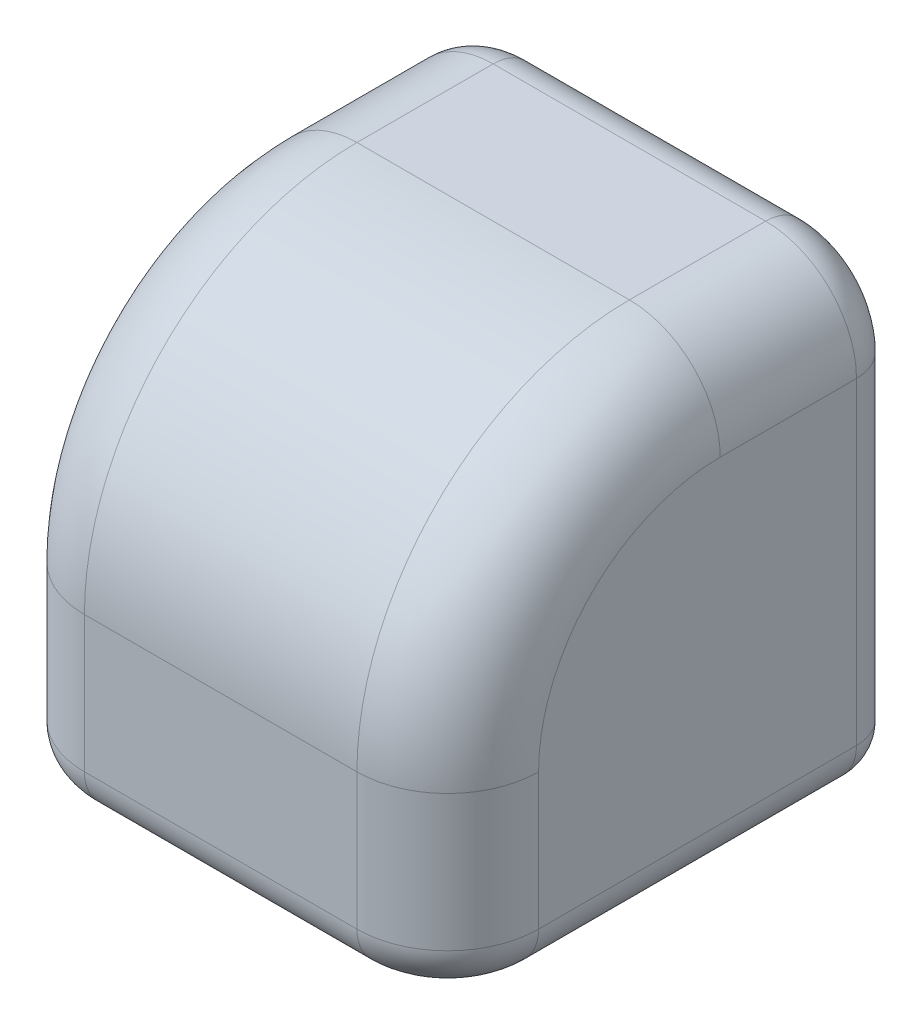
ISO-10303-21;
HEADER;
FILE_DESCRIPTION(('STEP AP214'),'2;1');
FILE_NAME('part.step','',(''),(''),'','','');
FILE_SCHEMA(('AUTOMOTIVE_DESIGN { 1 0 10303 214 1 1 1 1 }'));
ENDSEC;
DATA;
#1=APPLICATION_CONTEXT('core data for automotive mechanical design processes');
#2=APPLICATION_PROTOCOL_DEFINITION('international standard','automotive_design',2000,#1);
#3=PRODUCT_CONTEXT('',#1,'mechanical');
#4=PRODUCT('Part','Part','',(#3));
#5=PRODUCT_RELATED_PRODUCT_CATEGORY('part','',(#4));
#6=PRODUCT_DEFINITION_FORMATION('','',#4);
#7=PRODUCT_DEFINITION_CONTEXT('part definition',#1,'design');
#8=PRODUCT_DEFINITION('design','',#6,#7);
#9=PRODUCT_DEFINITION_SHAPE('','',#8);
#10=(LENGTH_UNIT() NAMED_UNIT(*) SI_UNIT(.MILLI.,.METRE.));
#11=(NAMED_UNIT(*) PLANE_ANGLE_UNIT() SI_UNIT($,.RADIAN.));
#12=(NAMED_UNIT(*) SI_UNIT($,.STERADIAN.) SOLID_ANGLE_UNIT());
#13=UNCERTAINTY_MEASURE_WITH_UNIT(LENGTH_MEASURE(1.E-05),#10,'distance_accuracy_value','');
#14=(GEOMETRIC_REPRESENTATION_CONTEXT(3) GLOBAL_UNCERTAINTY_ASSIGNED_CONTEXT((#13)) GLOBAL_UNIT_ASSIGNED_CONTEXT((#10,
#11,#12)) REPRESENTATION_CONTEXT('',''));
#15=CARTESIAN_POINT('',(0.,0.,0.));
#16=DIRECTION('',(0.,0.,1.));
#17=DIRECTION('',(1.,0.,0.));
#18=AXIS2_PLACEMENT_3D('',#15,#16,#17);
#19=CARTESIAN_POINT('',(0.,0.,0.));
#20=DIRECTION('',(0.,1.,0.));
#21=DIRECTION('',(0.,0.,1.));
#22=AXIS2_PLACEMENT_3D('',#19,#20,#21);
#23=PLANE('',#22);
#24=DIRECTION('',(0.,0.,1.));
#25=VECTOR('',#24,1.);
#26=CARTESIAN_POINT('',(-20.,0.,0.));
#27=LINE('',#26,#25);
#28=CARTESIAN_POINT('',(-20.,0.,0.));
#29=VERTEX_POINT('',#28);
#30=CARTESIAN_POINT('',(-20.,0.,-20.));
#31=VERTEX_POINT('',#30);
#32=EDGE_CURVE('E255',#29,#31,#27,.F.);
#33=ORIENTED_EDGE('',*,*,#32,.T.);
#34=DIRECTION('',(-1.,0.,0.));
#35=VECTOR('',#34,1.);
#36=CARTESIAN_POINT('',(0.,0.,-20.));
#37=LINE('',#36,#35);
#38=CARTESIAN_POINT('',(0.,0.,-20.));
#39=VERTEX_POINT('',#38);
#40=EDGE_CURVE('E11',#31,#39,#37,.F.);
#41=ORIENTED_EDGE('',*,*,#40,.T.);
#42=CARTESIAN_POINT('',(0.,0.,0.));
#43=DIRECTION('',(0.,-1.,0.));
#44=DIRECTION('',(0.,0.,-1.));
#45=AXIS2_PLACEMENT_3D('',#42,#43,#44);
#46=CIRCLE('',#45,20.);
#47=EDGE_CURVE('E556',#29,#39,#46,.T.);
#48=ORIENTED_EDGE('',*,*,#47,.F.);
#49=EDGE_LOOP('',(#33,#41,#48));
#50=FACE_BOUND('',#49,.T.);
#51=ADVANCED_FACE('F41',(#50),#23,.F.);
#52=CARTESIAN_POINT('',(-25.,50.,-25.));
#53=DIRECTION('',(0.,0.,1.));
#54=DIRECTION('',(1.,0.,0.));
#55=AXIS2_PLACEMENT_3D('',#52,#53,#54);
#56=PLANE('',#55);
#57=CARTESIAN_POINT('',(0.,25.,-25.));
#58=DIRECTION('',(0.,0.,-1.));
#59=DIRECTION('',(-1.,0.,0.));
#60=AXIS2_PLACEMENT_3D('',#57,#58,#59);
#61=CIRCLE('',#60,20.);
#62=CARTESIAN_POINT('',(0.,45.,-25.));
#63=VERTEX_POINT('',#62);
#64=CARTESIAN_POINT('',(20.,25.,-25.));
#65=VERTEX_POINT('',#64);
#66=EDGE_CURVE('E481',#63,#65,#61,.T.);
#67=ORIENTED_EDGE('',*,*,#66,.F.);
#68=DIRECTION('',(-1.,0.,0.));
#69=VECTOR('',#68,1.);
#70=CARTESIAN_POINT('',(15.,45.,-25.));
#71=LINE('',#70,#69);
#72=CARTESIAN_POINT('',(15.,45.,-25.));
#73=VERTEX_POINT('',#72);
#74=EDGE_CURVE('E339',#63,#73,#71,.F.);
#75=ORIENTED_EDGE('',*,*,#74,.T.);
#76=CARTESIAN_POINT('',(15.,40.,-25.));
#77=DIRECTION('',(0.,0.,1.));
#78=DIRECTION('',(1.,0.,0.));
#79=AXIS2_PLACEMENT_3D('',#76,#77,#78);
#80=CIRCLE('',#79,5.);
#81=CARTESIAN_POINT('',(20.,40.,-25.));
#82=VERTEX_POINT('',#81);
#83=EDGE_CURVE('E336',#73,#82,#80,.F.);
#84=ORIENTED_EDGE('',*,*,#83,.T.);
#85=DIRECTION('',(0.,-1.,0.));
#86=VECTOR('',#85,1.);
#87=CARTESIAN_POINT('',(20.,50.,-25.));
#88=LINE('',#87,#86);
#89=EDGE_CURVE('E323',#82,#65,#88,.T.);
#90=ORIENTED_EDGE('',*,*,#89,.T.);
#91=EDGE_LOOP('',(#67,#75,#84,#90));
#92=FACE_BOUND('',#91,.T.);
#93=ADVANCED_FACE('F508',(#92),#56,.F.);
#94=CARTESIAN_POINT('',(-15.,40.,-25.));
#95=DIRECTION('',(0.,0.,1.));
#96=DIRECTION('',(1.,0.,0.));
#97=AXIS2_PLACEMENT_3D('',#94,#95,#96);
#98=CIRCLE('',#97,5.);
#99=CARTESIAN_POINT('',(-20.,40.,-25.));
#100=VERTEX_POINT('',#99);
#101=CARTESIAN_POINT('',(-15.,45.,-25.));
#102=VERTEX_POINT('',#101);
#103=EDGE_CURVE('E330',#100,#102,#98,.F.);
#104=ORIENTED_EDGE('',*,*,#103,.T.);
#105=DIRECTION('',(-1.,0.,0.));
#106=VECTOR('',#105,1.);
#107=CARTESIAN_POINT('',(15.,45.,-25.));
#108=LINE('',#107,#106);
#109=EDGE_CURVE('E333',#102,#63,#108,.F.);
#110=ORIENTED_EDGE('',*,*,#109,.T.);
#111=CARTESIAN_POINT('',(-20.,25.,-25.));
#112=VERTEX_POINT('',#111);
#113=EDGE_CURVE('E477',#112,#63,#61,.T.);
#114=ORIENTED_EDGE('',*,*,#113,.F.);
#115=DIRECTION('',(0.,-1.,0.));
#116=VECTOR('',#115,1.);
#117=CARTESIAN_POINT('',(-20.,50.,-25.));
#118=LINE('',#117,#116);
#119=EDGE_CURVE('E327',#112,#100,#118,.F.);
#120=ORIENTED_EDGE('',*,*,#119,.T.);
#121=EDGE_LOOP('',(#104,#110,#114,#120));
#122=FACE_BOUND('',#121,.T.);
#123=ADVANCED_FACE('F512',(#122),#56,.F.);
#124=CARTESIAN_POINT('',(0.,5.,-25.));
#125=VERTEX_POINT('',#124);
#126=EDGE_CURVE('E498',#65,#125,#61,.T.);
#127=ORIENTED_EDGE('',*,*,#126,.F.);
#128=DIRECTION('',(0.,-1.,0.));
#129=VECTOR('',#128,1.);
#130=CARTESIAN_POINT('',(20.,50.,-25.));
#131=LINE('',#130,#129);
#132=CARTESIAN_POINT('',(20.,5.,-25.));
#133=VERTEX_POINT('',#132);
#134=EDGE_CURVE('E320',#65,#133,#131,.T.);
#135=ORIENTED_EDGE('',*,*,#134,.T.);
#136=DIRECTION('',(-1.,0.,0.));
#137=VECTOR('',#136,1.);
#138=CARTESIAN_POINT('',(-25.,5.,-25.));
#139=LINE('',#138,#137);
#140=EDGE_CURVE('E314',#133,#125,#139,.T.);
#141=ORIENTED_EDGE('',*,*,#140,.T.);
#142=EDGE_LOOP('',(#127,#135,#141));
#143=FACE_BOUND('',#142,.T.);
#144=ADVANCED_FACE('F509',(#143),#56,.F.);
#145=CARTESIAN_POINT('',(20.,0.,0.));
#146=VERTEX_POINT('',#145);
#147=EDGE_CURVE('E199',#39,#146,#46,.T.);
#148=ORIENTED_EDGE('',*,*,#147,.F.);
#149=DIRECTION('',(-1.,0.,0.));
#150=VECTOR('',#149,1.);
#151=CARTESIAN_POINT('',(0.,0.,-20.));
#152=LINE('',#151,#150);
#153=CARTESIAN_POINT('',(20.,0.,-20.));
#154=VERTEX_POINT('',#153);
#155=EDGE_CURVE('E51',#39,#154,#152,.F.);
#156=ORIENTED_EDGE('',*,*,#155,.T.);
#157=DIRECTION('',(0.,0.,-1.));
#158=VECTOR('',#157,1.);
#159=CARTESIAN_POINT('',(20.,0.,0.));
#160=LINE('',#159,#158);
#161=EDGE_CURVE('E276',#154,#146,#160,.F.);
#162=ORIENTED_EDGE('',*,*,#161,.T.);
#163=EDGE_LOOP('',(#148,#156,#162));
#164=FACE_BOUND('',#163,.T.);
#165=ADVANCED_FACE('F511',(#164),#23,.F.);
#166=CARTESIAN_POINT('',(0.,0.,20.));
#167=VERTEX_POINT('',#166);
#168=EDGE_CURVE('E486',#146,#167,#46,.T.);
#169=ORIENTED_EDGE('',*,*,#168,.F.);
#170=DIRECTION('',(0.,0.,-1.));
#171=VECTOR('',#170,1.);
#172=CARTESIAN_POINT('',(20.,0.,0.));
#173=LINE('',#172,#171);
#174=CARTESIAN_POINT('',(20.,0.,15.));
#175=VERTEX_POINT('',#174);
#176=EDGE_CURVE('E273',#146,#175,#173,.F.);
#177=ORIENTED_EDGE('',*,*,#176,.T.);
#178=CARTESIAN_POINT('',(15.,0.,15.));
#179=DIRECTION('',(0.,1.,0.));
#180=DIRECTION('',(0.,0.,1.));
#181=AXIS2_PLACEMENT_3D('',#178,#179,#180);
#182=CIRCLE('',#181,5.);
#183=CARTESIAN_POINT('',(15.,0.,20.));
#184=VERTEX_POINT('',#183);
#185=EDGE_CURVE('E270',#175,#184,#182,.F.);
#186=ORIENTED_EDGE('',*,*,#185,.T.);
#187=DIRECTION('',(1.,0.,0.));
#188=VECTOR('',#187,1.);
#189=CARTESIAN_POINT('',(0.,0.,20.));
#190=LINE('',#189,#188);
#191=EDGE_CURVE('E267',#184,#167,#190,.F.);
#192=ORIENTED_EDGE('',*,*,#191,.T.);
#193=EDGE_LOOP('',(#169,#177,#186,#192));
#194=FACE_BOUND('',#193,.T.);
#195=ADVANCED_FACE('F519',(#194),#23,.F.);
#196=CARTESIAN_POINT('',(25.,50.,-25.));
#197=DIRECTION('',(-1.,0.,0.));
#198=DIRECTION('',(0.,0.,1.));
#199=AXIS2_PLACEMENT_3D('',#196,#197,#198);
#200=PLANE('',#199);
#201=DIRECTION('',(0.,0.,-1.));
#202=VECTOR('',#201,1.);
#203=CARTESIAN_POINT('',(25.,5.,-25.));
#204=LINE('',#203,#202);
#205=CARTESIAN_POINT('',(25.,5.,15.));
#206=VERTEX_POINT('',#205);
#207=CARTESIAN_POINT('',(25.,5.,-20.));
#208=VERTEX_POINT('',#207);
#209=EDGE_CURVE('E244',#206,#208,#204,.T.);
#210=ORIENTED_EDGE('',*,*,#209,.T.);
#211=DIRECTION('',(0.,-1.,0.));
#212=VECTOR('',#211,1.);
#213=CARTESIAN_POINT('',(25.,50.,-20.));
#214=LINE('',#213,#212);
#215=CARTESIAN_POINT('',(25.,40.,-20.));
#216=VERTEX_POINT('',#215);
#217=EDGE_CURVE('E184',#208,#216,#214,.F.);
#218=ORIENTED_EDGE('',*,*,#217,.T.);
#219=DIRECTION('',(0.,0.,-1.));
#220=VECTOR('',#219,1.);
#221=CARTESIAN_POINT('',(25.,40.,-4.99999999999999));
#222=LINE('',#221,#220);
#223=CARTESIAN_POINT('',(25.,40.,-4.99999999999999));
#224=VERTEX_POINT('',#223);
#225=EDGE_CURVE('E175',#216,#224,#222,.F.);
#226=ORIENTED_EDGE('',*,*,#225,.T.);
#227=CARTESIAN_POINT('',(25.,20.,-4.99999999999999));
#228=DIRECTION('',(-1.,0.,0.));
#229=DIRECTION('',(0.,0.,1.));
#230=AXIS2_PLACEMENT_3D('',#227,#228,#229);
#231=CIRCLE('',#230,20.);
#232=CARTESIAN_POINT('',(25.,20.,15.));
#233=VERTEX_POINT('',#232);
#234=EDGE_CURVE('E181',#224,#233,#231,.F.);
#235=ORIENTED_EDGE('',*,*,#234,.T.);
#236=DIRECTION('',(0.,-1.,0.));
#237=VECTOR('',#236,1.);
#238=CARTESIAN_POINT('',(25.,50.,15.));
#239=LINE('',#238,#237);
#240=EDGE_CURVE('E206',#233,#206,#239,.T.);
#241=ORIENTED_EDGE('',*,*,#240,.T.);
#242=EDGE_LOOP('',(#210,#218,#226,#235,#241));
#243=FACE_BOUND('',#242,.T.);
#244=ADVANCED_FACE('F178',(#243),#200,.F.);
#245=DIRECTION('',(-1.,0.,0.));
#246=VECTOR('',#245,1.);
#247=CARTESIAN_POINT('',(-25.,5.,-25.));
#248=LINE('',#247,#246);
#249=CARTESIAN_POINT('',(-20.,5.,-25.));
#250=VERTEX_POINT('',#249);
#251=EDGE_CURVE('E311',#125,#250,#248,.T.);
#252=ORIENTED_EDGE('',*,*,#251,.T.);
#253=DIRECTION('',(0.,-1.,0.));
#254=VECTOR('',#253,1.);
#255=CARTESIAN_POINT('',(-20.,50.,-25.));
#256=LINE('',#255,#254);
#257=EDGE_CURVE('E317',#250,#112,#256,.F.);
#258=ORIENTED_EDGE('',*,*,#257,.T.);
#259=EDGE_CURVE('E482',#125,#112,#61,.T.);
#260=ORIENTED_EDGE('',*,*,#259,.F.);
#261=EDGE_LOOP('',(#252,#258,#260));
#262=FACE_BOUND('',#261,.T.);
#263=ADVANCED_FACE('F514',(#262),#56,.F.);
#264=CARTESIAN_POINT('',(-25.,50.,-25.));
#265=DIRECTION('',(1.,0.,0.));
#266=DIRECTION('',(0.,0.,-1.));
#267=AXIS2_PLACEMENT_3D('',#264,#265,#266);
#268=PLANE('',#267);
#269=DIRECTION('',(0.,0.,1.));
#270=VECTOR('',#269,1.);
#271=CARTESIAN_POINT('',(-25.,40.,-25.));
#272=LINE('',#271,#270);
#273=CARTESIAN_POINT('',(-25.,40.,-4.99999999999999));
#274=VERTEX_POINT('',#273);
#275=CARTESIAN_POINT('',(-25.,40.,-20.));
#276=VERTEX_POINT('',#275);
#277=EDGE_CURVE('E228',#274,#276,#272,.F.);
#278=ORIENTED_EDGE('',*,*,#277,.T.);
#279=DIRECTION('',(0.,-1.,0.));
#280=VECTOR('',#279,1.);
#281=CARTESIAN_POINT('',(-25.,50.,-20.));
#282=LINE('',#281,#280);
#283=CARTESIAN_POINT('',(-25.,5.,-20.));
#284=VERTEX_POINT('',#283);
#285=EDGE_CURVE('E353',#276,#284,#282,.T.);
#286=ORIENTED_EDGE('',*,*,#285,.T.);
#287=DIRECTION('',(0.,0.,1.));
#288=VECTOR('',#287,1.);
#289=CARTESIAN_POINT('',(-25.,5.,-25.));
#290=LINE('',#289,#288);
#291=CARTESIAN_POINT('',(-25.,5.,15.));
#292=VERTEX_POINT('',#291);
#293=EDGE_CURVE('E289',#284,#292,#290,.T.);
#294=ORIENTED_EDGE('',*,*,#293,.T.);
#295=DIRECTION('',(0.,-1.,0.));
#296=VECTOR('',#295,1.);
#297=CARTESIAN_POINT('',(-25.,50.,15.));
#298=LINE('',#297,#296);
#299=CARTESIAN_POINT('',(-25.,20.,15.));
#300=VERTEX_POINT('',#299);
#301=EDGE_CURVE('E235',#292,#300,#298,.F.);
#302=ORIENTED_EDGE('',*,*,#301,.T.);
#303=CARTESIAN_POINT('',(-25.,20.,-4.99999999999999));
#304=DIRECTION('',(1.,0.,0.));
#305=DIRECTION('',(0.,0.,-1.));
#306=AXIS2_PLACEMENT_3D('',#303,#304,#305);
#307=CIRCLE('',#306,20.);
#308=EDGE_CURVE('E232',#300,#274,#307,.F.);
#309=ORIENTED_EDGE('',*,*,#308,.T.);
#310=EDGE_LOOP('',(#278,#286,#294,#302,#309));
#311=FACE_BOUND('',#310,.T.);
#312=ADVANCED_FACE('F407',(#311),#268,.F.);
#313=CARTESIAN_POINT('',(-25.,50.,25.));
#314=DIRECTION('',(0.,0.,-1.));
#315=DIRECTION('',(-1.,0.,0.));
#316=AXIS2_PLACEMENT_3D('',#313,#314,#315);
#317=PLANE('',#316);
#318=DIRECTION('',(0.,-1.,0.));
#319=VECTOR('',#318,1.);
#320=CARTESIAN_POINT('',(-15.,50.,25.));
#321=LINE('',#320,#319);
#322=CARTESIAN_POINT('',(-15.,20.,25.));
#323=VERTEX_POINT('',#322);
#324=CARTESIAN_POINT('',(-15.,5.,25.));
#325=VERTEX_POINT('',#324);
#326=EDGE_CURVE('E221',#323,#325,#321,.T.);
#327=ORIENTED_EDGE('',*,*,#326,.T.);
#328=DIRECTION('',(1.,0.,0.));
#329=VECTOR('',#328,1.);
#330=CARTESIAN_POINT('',(-25.,5.,25.));
#331=LINE('',#330,#329);
#332=CARTESIAN_POINT('',(15.,5.,25.));
#333=VERTEX_POINT('',#332);
#334=EDGE_CURVE('E283',#325,#333,#331,.T.);
#335=ORIENTED_EDGE('',*,*,#334,.T.);
#336=DIRECTION('',(0.,-1.,0.));
#337=VECTOR('',#336,1.);
#338=CARTESIAN_POINT('',(15.,50.,25.));
#339=LINE('',#338,#337);
#340=CARTESIAN_POINT('',(15.,20.,25.));
#341=VERTEX_POINT('',#340);
#342=EDGE_CURVE('E209',#333,#341,#339,.F.);
#343=ORIENTED_EDGE('',*,*,#342,.T.);
#344=DIRECTION('',(1.,0.,0.));
#345=VECTOR('',#344,1.);
#346=CARTESIAN_POINT('',(-25.,20.,25.));
#347=LINE('',#346,#345);
#348=EDGE_CURVE('E188',#341,#323,#347,.F.);
#349=ORIENTED_EDGE('',*,*,#348,.T.);
#350=EDGE_LOOP('',(#327,#335,#343,#349));
#351=FACE_BOUND('',#350,.T.);
#352=ADVANCED_FACE('F422',(#351),#317,.F.);
#353=CARTESIAN_POINT('',(0.,50.,0.));
#354=DIRECTION('',(0.,1.,0.));
#355=DIRECTION('',(0.,0.,1.));
#356=AXIS2_PLACEMENT_3D('',#353,#354,#355);
#357=PLANE('',#356);
#358=DIRECTION('',(0.,0.,-1.));
#359=VECTOR('',#358,1.);
#360=CARTESIAN_POINT('',(15.,50.,-25.));
#361=LINE('',#360,#359);
#362=CARTESIAN_POINT('',(15.,50.,-4.99999999999999));
#363=VERTEX_POINT('',#362);
#364=CARTESIAN_POINT('',(15.,50.,-20.));
#365=VERTEX_POINT('',#364);
#366=EDGE_CURVE('E195',#363,#365,#361,.T.);
#367=ORIENTED_EDGE('',*,*,#366,.T.);
#368=DIRECTION('',(-1.,0.,0.));
#369=VECTOR('',#368,1.);
#370=CARTESIAN_POINT('',(-15.,50.,-20.));
#371=LINE('',#370,#369);
#372=CARTESIAN_POINT('',(-15.,50.,-20.));
#373=VERTEX_POINT('',#372);
#374=EDGE_CURVE('E347',#365,#373,#371,.T.);
#375=ORIENTED_EDGE('',*,*,#374,.T.);
#376=DIRECTION('',(0.,0.,1.));
#377=VECTOR('',#376,1.);
#378=CARTESIAN_POINT('',(-15.,50.,-4.99999999999999));
#379=LINE('',#378,#377);
#380=CARTESIAN_POINT('',(-15.,50.,-4.99999999999999));
#381=VERTEX_POINT('',#380);
#382=EDGE_CURVE('E241',#373,#381,#379,.T.);
#383=ORIENTED_EDGE('',*,*,#382,.T.);
#384=DIRECTION('',(1.,0.,0.));
#385=VECTOR('',#384,1.);
#386=CARTESIAN_POINT('',(25.,50.,-4.99999999999999));
#387=LINE('',#386,#385);
#388=EDGE_CURVE('E469',#381,#363,#387,.T.);
#389=ORIENTED_EDGE('',*,*,#388,.T.);
#390=EDGE_LOOP('',(#367,#375,#383,#389));
#391=FACE_BOUND('',#390,.T.);
#392=ADVANCED_FACE('F467',(#391),#357,.T.);
#393=EDGE_CURVE('E491',#167,#29,#46,.T.);
#394=ORIENTED_EDGE('',*,*,#393,.F.);
#395=DIRECTION('',(1.,0.,0.));
#396=VECTOR('',#395,1.);
#397=CARTESIAN_POINT('',(0.,0.,20.));
#398=LINE('',#397,#396);
#399=CARTESIAN_POINT('',(-15.,0.,20.));
#400=VERTEX_POINT('',#399);
#401=EDGE_CURVE('E264',#167,#400,#398,.F.);
#402=ORIENTED_EDGE('',*,*,#401,.T.);
#403=CARTESIAN_POINT('',(-15.,0.,15.));
#404=DIRECTION('',(0.,1.,0.));
#405=DIRECTION('',(0.,0.,1.));
#406=AXIS2_PLACEMENT_3D('',#403,#404,#405);
#407=CIRCLE('',#406,5.);
#408=CARTESIAN_POINT('',(-20.,0.,15.));
#409=VERTEX_POINT('',#408);
#410=EDGE_CURVE('E261',#400,#409,#407,.F.);
#411=ORIENTED_EDGE('',*,*,#410,.T.);
#412=DIRECTION('',(0.,0.,1.));
#413=VECTOR('',#412,1.);
#414=CARTESIAN_POINT('',(-20.,0.,0.));
#415=LINE('',#414,#413);
#416=EDGE_CURVE('E258',#409,#29,#415,.F.);
#417=ORIENTED_EDGE('',*,*,#416,.T.);
#418=EDGE_LOOP('',(#394,#402,#411,#417));
#419=FACE_BOUND('',#418,.T.);
#420=ADVANCED_FACE('F528',(#419),#23,.F.);
#421=CARTESIAN_POINT('',(0.,25.,-20.));
#422=DIRECTION('',(0.,0.,-1.));
#423=DIRECTION('',(-1.,0.,0.));
#424=AXIS2_PLACEMENT_3D('',#421,#422,#423);
#425=CYLINDRICAL_SURFACE('',#424,20.);
#426=CARTESIAN_POINT('',(0.,25.,-20.));
#427=DIRECTION('',(0.,0.,-1.));
#428=DIRECTION('',(-1.,0.,0.));
#429=AXIS2_PLACEMENT_3D('',#426,#427,#428);
#430=CIRCLE('',#429,20.);
#431=CARTESIAN_POINT('',(-20.,25.,-20.));
#432=VERTEX_POINT('',#431);
#433=EDGE_CURVE('E472',#432,#432,#430,.T.);
#434=ORIENTED_EDGE('',*,*,#433,.F.);
#435=EDGE_LOOP('',(#434));
#436=FACE_BOUND('',#435,.T.);
#437=ORIENTED_EDGE('',*,*,#113,.T.);
#438=ORIENTED_EDGE('',*,*,#66,.T.);
#439=ORIENTED_EDGE('',*,*,#126,.T.);
#440=ORIENTED_EDGE('',*,*,#259,.T.);
#441=EDGE_LOOP('',(#437,#438,#439,#440));
#442=FACE_BOUND('',#441,.T.);
#443=ADVANCED_FACE('F506',(#436,#442),#425,.F.);
#444=CARTESIAN_POINT('',(0.,25.,-20.));
#445=DIRECTION('',(0.,0.,-1.));
#446=DIRECTION('',(-1.,0.,0.));
#447=AXIS2_PLACEMENT_3D('',#444,#445,#446);
#448=PLANE('',#447);
#449=ORIENTED_EDGE('',*,*,#433,.T.);
#450=EDGE_LOOP('',(#449));
#451=FACE_BOUND('',#450,.T.);
#452=ADVANCED_FACE('F540',(#451),#448,.T.);
#453=CARTESIAN_POINT('',(0.,2.,0.));
#454=DIRECTION('',(0.,-1.,0.));
#455=DIRECTION('',(0.,0.,-1.));
#456=AXIS2_PLACEMENT_3D('',#453,#454,#455);
#457=CYLINDRICAL_SURFACE('',#456,20.);
#458=CARTESIAN_POINT('',(0.,2.,0.));
#459=DIRECTION('',(0.,-1.,0.));
#460=DIRECTION('',(0.,0.,-1.));
#461=AXIS2_PLACEMENT_3D('',#458,#459,#460);
#462=CIRCLE('',#461,20.);
#463=CARTESIAN_POINT('',(0.,2.,-20.));
#464=VERTEX_POINT('',#463);
#465=EDGE_CURVE('E490',#464,#464,#462,.T.);
#466=ORIENTED_EDGE('',*,*,#465,.F.);
#467=EDGE_LOOP('',(#466));
#468=FACE_BOUND('',#467,.T.);
#469=ORIENTED_EDGE('',*,*,#168,.T.);
#470=ORIENTED_EDGE('',*,*,#393,.T.);
#471=ORIENTED_EDGE('',*,*,#47,.T.);
#472=ORIENTED_EDGE('',*,*,#147,.T.);
#473=EDGE_LOOP('',(#469,#470,#471,#472));
#474=FACE_BOUND('',#473,.T.);
#475=ADVANCED_FACE('F552',(#468,#474),#457,.F.);
#476=CARTESIAN_POINT('',(0.,2.,0.));
#477=DIRECTION('',(0.,-1.,0.));
#478=DIRECTION('',(0.,0.,-1.));
#479=AXIS2_PLACEMENT_3D('',#476,#477,#478);
#480=PLANE('',#479);
#481=ORIENTED_EDGE('',*,*,#465,.T.);
#482=EDGE_LOOP('',(#481));
#483=FACE_BOUND('',#482,.T.);
#484=ADVANCED_FACE('F605',(#483),#480,.T.);
#485=CARTESIAN_POINT('',(0.,20.,-4.99999999999999));
#486=DIRECTION('',(-1.,0.,0.));
#487=DIRECTION('',(0.,0.,1.));
#488=AXIS2_PLACEMENT_3D('',#485,#486,#487);
#489=CYLINDRICAL_SURFACE('',#488,30.);
#490=ORIENTED_EDGE('',*,*,#388,.F.);
#491=CARTESIAN_POINT('',(-15.,20.,-4.99999999999999));
#492=DIRECTION('',(1.,0.,0.));
#493=DIRECTION('',(0.,0.,-1.));
#494=AXIS2_PLACEMENT_3D('',#491,#492,#493);
#495=CIRCLE('',#494,30.);
#496=EDGE_CURVE('E238',#381,#323,#495,.T.);
#497=ORIENTED_EDGE('',*,*,#496,.T.);
#498=ORIENTED_EDGE('',*,*,#348,.F.);
#499=CARTESIAN_POINT('',(15.,20.,-4.99999999999999));
#500=DIRECTION('',(-1.,0.,0.));
#501=DIRECTION('',(0.,0.,1.));
#502=AXIS2_PLACEMENT_3D('',#499,#500,#501);
#503=CIRCLE('',#502,30.);
#504=EDGE_CURVE('E215',#341,#363,#503,.T.);
#505=ORIENTED_EDGE('',*,*,#504,.T.);
#506=EDGE_LOOP('',(#490,#497,#498,#505));
#507=FACE_BOUND('',#506,.T.);
#508=ADVANCED_FACE('F474',(#507),#489,.T.);
#509=CARTESIAN_POINT('',(15.,40.,0.));
#510=DIRECTION('',(0.,0.,1.));
#511=DIRECTION('',(1.,0.,0.));
#512=AXIS2_PLACEMENT_3D('',#509,#510,#511);
#513=CYLINDRICAL_SURFACE('',#512,10.);
#514=ORIENTED_EDGE('',*,*,#225,.F.);
#515=CARTESIAN_POINT('',(15.,40.,-20.));
#516=DIRECTION('',(0.,0.,1.));
#517=DIRECTION('',(1.,0.,0.));
#518=AXIS2_PLACEMENT_3D('',#515,#516,#517);
#519=CIRCLE('',#518,10.);
#520=EDGE_CURVE('E344',#216,#365,#519,.T.);
#521=ORIENTED_EDGE('',*,*,#520,.T.);
#522=ORIENTED_EDGE('',*,*,#366,.F.);
#523=CARTESIAN_POINT('',(15.,40.,-4.99999999999999));
#524=DIRECTION('',(0.,0.,1.));
#525=DIRECTION('',(1.,0.,0.));
#526=AXIS2_PLACEMENT_3D('',#523,#524,#525);
#527=CIRCLE('',#526,10.);
#528=EDGE_CURVE('E192',#224,#363,#527,.T.);
#529=ORIENTED_EDGE('',*,*,#528,.F.);
#530=EDGE_LOOP('',(#514,#521,#522,#529));
#531=FACE_BOUND('',#530,.T.);
#532=ADVANCED_FACE('F193',(#531),#513,.T.);
#533=CARTESIAN_POINT('',(15.,20.,-4.99999999999999));
#534=DIRECTION('',(-1.,0.,0.));
#535=DIRECTION('',(0.,0.,1.));
#536=AXIS2_PLACEMENT_3D('',#533,#534,#535);
#537=TOROIDAL_SURFACE('',#536,20.,10.);
#538=ORIENTED_EDGE('',*,*,#528,.T.);
#539=ORIENTED_EDGE('',*,*,#504,.F.);
#540=CARTESIAN_POINT('',(15.,20.,15.));
#541=DIRECTION('',(0.,-1.,0.));
#542=DIRECTION('',(0.,0.,-1.));
#543=AXIS2_PLACEMENT_3D('',#540,#541,#542);
#544=CIRCLE('',#543,10.);
#545=EDGE_CURVE('E200',#233,#341,#544,.T.);
#546=ORIENTED_EDGE('',*,*,#545,.F.);
#547=ORIENTED_EDGE('',*,*,#234,.F.);
#548=EDGE_LOOP('',(#538,#539,#546,#547));
#549=FACE_BOUND('',#548,.T.);
#550=ADVANCED_FACE('F202',(#549),#537,.T.);
#551=CARTESIAN_POINT('',(15.,50.,15.));
#552=DIRECTION('',(0.,-1.,0.));
#553=DIRECTION('',(0.,0.,-1.));
#554=AXIS2_PLACEMENT_3D('',#551,#552,#553);
#555=CYLINDRICAL_SURFACE('',#554,10.);
#556=ORIENTED_EDGE('',*,*,#342,.F.);
#557=CARTESIAN_POINT('',(15.,5.,15.));
#558=DIRECTION('',(0.,1.,0.));
#559=DIRECTION('',(0.,0.,1.));
#560=AXIS2_PLACEMENT_3D('',#557,#558,#559);
#561=CIRCLE('',#560,10.);
#562=EDGE_CURVE('E280',#333,#206,#561,.T.);
#563=ORIENTED_EDGE('',*,*,#562,.T.);
#564=ORIENTED_EDGE('',*,*,#240,.F.);
#565=ORIENTED_EDGE('',*,*,#545,.T.);
#566=EDGE_LOOP('',(#556,#563,#564,#565));
#567=FACE_BOUND('',#566,.T.);
#568=ADVANCED_FACE('F441',(#567),#555,.T.);
#569=CARTESIAN_POINT('',(-15.,40.,0.));
#570=DIRECTION('',(0.,0.,-1.));
#571=DIRECTION('',(-1.,0.,0.));
#572=AXIS2_PLACEMENT_3D('',#569,#570,#571);
#573=CYLINDRICAL_SURFACE('',#572,10.);
#574=ORIENTED_EDGE('',*,*,#382,.F.);
#575=CARTESIAN_POINT('',(-15.,40.,-20.));
#576=DIRECTION('',(0.,0.,1.));
#577=DIRECTION('',(1.,0.,0.));
#578=AXIS2_PLACEMENT_3D('',#575,#576,#577);
#579=CIRCLE('',#578,10.);
#580=EDGE_CURVE('E350',#373,#276,#579,.T.);
#581=ORIENTED_EDGE('',*,*,#580,.T.);
#582=ORIENTED_EDGE('',*,*,#277,.F.);
#583=CARTESIAN_POINT('',(-15.,40.,-4.99999999999999));
#584=DIRECTION('',(0.,0.,1.));
#585=DIRECTION('',(1.,0.,0.));
#586=AXIS2_PLACEMENT_3D('',#583,#584,#585);
#587=CIRCLE('',#586,10.);
#588=EDGE_CURVE('E223',#381,#274,#587,.T.);
#589=ORIENTED_EDGE('',*,*,#588,.F.);
#590=EDGE_LOOP('',(#574,#581,#582,#589));
#591=FACE_BOUND('',#590,.T.);
#592=ADVANCED_FACE('F404',(#591),#573,.T.);
#593=CARTESIAN_POINT('',(-15.,20.,-4.99999999999999));
#594=DIRECTION('',(1.,0.,0.));
#595=DIRECTION('',(0.,0.,-1.));
#596=AXIS2_PLACEMENT_3D('',#593,#594,#595);
#597=TOROIDAL_SURFACE('',#596,20.,10.);
#598=ORIENTED_EDGE('',*,*,#588,.T.);
#599=ORIENTED_EDGE('',*,*,#308,.F.);
#600=CARTESIAN_POINT('',(-15.,20.,15.));
#601=DIRECTION('',(0.,-1.,0.));
#602=DIRECTION('',(0.,0.,-1.));
#603=AXIS2_PLACEMENT_3D('',#600,#601,#602);
#604=CIRCLE('',#603,10.);
#605=EDGE_CURVE('E245',#323,#300,#604,.T.);
#606=ORIENTED_EDGE('',*,*,#605,.F.);
#607=ORIENTED_EDGE('',*,*,#496,.F.);
#608=EDGE_LOOP('',(#598,#599,#606,#607));
#609=FACE_BOUND('',#608,.T.);
#610=ADVANCED_FACE('F412',(#609),#597,.T.);
#611=CARTESIAN_POINT('',(-15.,50.,15.));
#612=DIRECTION('',(0.,-1.,0.));
#613=DIRECTION('',(0.,0.,-1.));
#614=AXIS2_PLACEMENT_3D('',#611,#612,#613);
#615=CYLINDRICAL_SURFACE('',#614,10.);
#616=ORIENTED_EDGE('',*,*,#301,.F.);
#617=CARTESIAN_POINT('',(-15.,5.,15.));
#618=DIRECTION('',(0.,1.,0.));
#619=DIRECTION('',(0.,0.,1.));
#620=AXIS2_PLACEMENT_3D('',#617,#618,#619);
#621=CIRCLE('',#620,10.);
#622=EDGE_CURVE('E286',#292,#325,#621,.T.);
#623=ORIENTED_EDGE('',*,*,#622,.T.);
#624=ORIENTED_EDGE('',*,*,#326,.F.);
#625=ORIENTED_EDGE('',*,*,#605,.T.);
#626=EDGE_LOOP('',(#616,#623,#624,#625));
#627=FACE_BOUND('',#626,.T.);
#628=ADVANCED_FACE('F416',(#627),#615,.T.);
#629=CARTESIAN_POINT('',(-20.,5.,-25.));
#630=DIRECTION('',(0.,0.,1.));
#631=DIRECTION('',(1.,0.,0.));
#632=AXIS2_PLACEMENT_3D('',#629,#630,#631);
#633=CYLINDRICAL_SURFACE('',#632,5.);
#634=ORIENTED_EDGE('',*,*,#293,.F.);
#635=CARTESIAN_POINT('',(-20.,5.,-20.));
#636=DIRECTION('',(0.,0.,1.));
#637=DIRECTION('',(1.,0.,0.));
#638=AXIS2_PLACEMENT_3D('',#635,#636,#637);
#639=CIRCLE('',#638,5.);
#640=EDGE_CURVE('E65',#284,#31,#639,.T.);
#641=ORIENTED_EDGE('',*,*,#640,.T.);
#642=ORIENTED_EDGE('',*,*,#32,.F.);
#643=ORIENTED_EDGE('',*,*,#416,.F.);
#644=CARTESIAN_POINT('',(-20.,5.,15.));
#645=DIRECTION('',(0.,0.,1.));
#646=DIRECTION('',(1.,0.,0.));
#647=AXIS2_PLACEMENT_3D('',#644,#645,#646);
#648=CIRCLE('',#647,5.);
#649=EDGE_CURVE('E249',#292,#409,#648,.T.);
#650=ORIENTED_EDGE('',*,*,#649,.F.);
#651=EDGE_LOOP('',(#634,#641,#642,#643,#650));
#652=FACE_BOUND('',#651,.T.);
#653=ADVANCED_FACE('F581',(#652),#633,.T.);
#654=CARTESIAN_POINT('',(-15.,5.,15.));
#655=DIRECTION('',(0.,1.,0.));
#656=DIRECTION('',(0.,0.,1.));
#657=AXIS2_PLACEMENT_3D('',#654,#655,#656);
#658=DEGENERATE_TOROIDAL_SURFACE('',#657,5.,5.,.T.);
#659=ORIENTED_EDGE('',*,*,#649,.T.);
#660=ORIENTED_EDGE('',*,*,#410,.F.);
#661=CARTESIAN_POINT('',(-15.,5.,20.));
#662=DIRECTION('',(1.,0.,0.));
#663=DIRECTION('',(0.,0.,-1.));
#664=AXIS2_PLACEMENT_3D('',#661,#662,#663);
#665=CIRCLE('',#664,5.);
#666=EDGE_CURVE('E301',#325,#400,#665,.T.);
#667=ORIENTED_EDGE('',*,*,#666,.F.);
#668=ORIENTED_EDGE('',*,*,#622,.F.);
#669=EDGE_LOOP('',(#659,#660,#667,#668));
#670=FACE_BOUND('',#669,.T.);
#671=ADVANCED_FACE('F428',(#670),#658,.T.);
#672=CARTESIAN_POINT('',(-25.,5.,20.));
#673=DIRECTION('',(1.,0.,0.));
#674=DIRECTION('',(0.,0.,-1.));
#675=AXIS2_PLACEMENT_3D('',#672,#673,#674);
#676=CYLINDRICAL_SURFACE('',#675,5.);
#677=ORIENTED_EDGE('',*,*,#401,.F.);
#678=ORIENTED_EDGE('',*,*,#191,.F.);
#679=CARTESIAN_POINT('',(15.,5.,20.));
#680=DIRECTION('',(1.,0.,0.));
#681=DIRECTION('',(0.,0.,-1.));
#682=AXIS2_PLACEMENT_3D('',#679,#680,#681);
#683=CIRCLE('',#682,5.);
#684=EDGE_CURVE('E297',#333,#184,#683,.T.);
#685=ORIENTED_EDGE('',*,*,#684,.F.);
#686=ORIENTED_EDGE('',*,*,#334,.F.);
#687=ORIENTED_EDGE('',*,*,#666,.T.);
#688=EDGE_LOOP('',(#677,#678,#685,#686,#687));
#689=FACE_BOUND('',#688,.T.);
#690=ADVANCED_FACE('F432',(#689),#676,.T.);
#691=CARTESIAN_POINT('',(15.,5.,15.));
#692=DIRECTION('',(0.,1.,0.));
#693=DIRECTION('',(0.,0.,1.));
#694=AXIS2_PLACEMENT_3D('',#691,#692,#693);
#695=DEGENERATE_TOROIDAL_SURFACE('',#694,5.,5.,.T.);
#696=ORIENTED_EDGE('',*,*,#684,.T.);
#697=ORIENTED_EDGE('',*,*,#185,.F.);
#698=CARTESIAN_POINT('',(20.,5.,15.));
#699=DIRECTION('',(0.,0.,-1.));
#700=DIRECTION('',(-1.,0.,0.));
#701=AXIS2_PLACEMENT_3D('',#698,#699,#700);
#702=CIRCLE('',#701,5.);
#703=EDGE_CURVE('E293',#206,#175,#702,.T.);
#704=ORIENTED_EDGE('',*,*,#703,.F.);
#705=ORIENTED_EDGE('',*,*,#562,.F.);
#706=EDGE_LOOP('',(#696,#697,#704,#705));
#707=FACE_BOUND('',#706,.T.);
#708=ADVANCED_FACE('F438',(#707),#695,.T.);
#709=CARTESIAN_POINT('',(20.,5.,-25.));
#710=DIRECTION('',(0.,0.,-1.));
#711=DIRECTION('',(-1.,0.,0.));
#712=AXIS2_PLACEMENT_3D('',#709,#710,#711);
#713=CYLINDRICAL_SURFACE('',#712,5.);
#714=ORIENTED_EDGE('',*,*,#161,.F.);
#715=CARTESIAN_POINT('',(20.,5.,-20.));
#716=DIRECTION('',(0.,0.,-1.));
#717=DIRECTION('',(-1.,0.,0.));
#718=AXIS2_PLACEMENT_3D('',#715,#716,#717);
#719=CIRCLE('',#718,5.);
#720=EDGE_CURVE('E292',#154,#208,#719,.F.);
#721=ORIENTED_EDGE('',*,*,#720,.T.);
#722=ORIENTED_EDGE('',*,*,#209,.F.);
#723=ORIENTED_EDGE('',*,*,#703,.T.);
#724=ORIENTED_EDGE('',*,*,#176,.F.);
#725=EDGE_LOOP('',(#714,#721,#722,#723,#724));
#726=FACE_BOUND('',#725,.T.);
#727=ADVANCED_FACE('F444',(#726),#713,.T.);
#728=CARTESIAN_POINT('',(-15.,40.,-20.));
#729=DIRECTION('',(0.,0.,1.));
#730=DIRECTION('',(1.,0.,0.));
#731=AXIS2_PLACEMENT_3D('',#728,#729,#730);
#732=DEGENERATE_TOROIDAL_SURFACE('',#731,5.,5.,.T.);
#733=CARTESIAN_POINT('',(-20.,40.,-20.));
#734=DIRECTION('',(0.,-1.,0.));
#735=DIRECTION('',(0.,0.,-1.));
#736=AXIS2_PLACEMENT_3D('',#733,#734,#735);
#737=CIRCLE('',#736,5.);
#738=EDGE_CURVE('E382',#276,#100,#737,.T.);
#739=ORIENTED_EDGE('',*,*,#738,.F.);
#740=ORIENTED_EDGE('',*,*,#580,.F.);
#741=CARTESIAN_POINT('',(-15.,45.,-20.));
#742=DIRECTION('',(1.,0.,0.));
#743=DIRECTION('',(0.,0.,-1.));
#744=AXIS2_PLACEMENT_3D('',#741,#742,#743);
#745=CIRCLE('',#744,5.);
#746=EDGE_CURVE('E45',#102,#373,#745,.T.);
#747=ORIENTED_EDGE('',*,*,#746,.F.);
#748=ORIENTED_EDGE('',*,*,#103,.F.);
#749=EDGE_LOOP('',(#739,#740,#747,#748));
#750=FACE_BOUND('',#749,.T.);
#751=ADVANCED_FACE('F43',(#750),#732,.T.);
#752=CARTESIAN_POINT('',(0.,45.,-20.));
#753=DIRECTION('',(1.,0.,0.));
#754=DIRECTION('',(0.,0.,-1.));
#755=AXIS2_PLACEMENT_3D('',#752,#753,#754);
#756=CYLINDRICAL_SURFACE('',#755,5.);
#757=ORIENTED_EDGE('',*,*,#746,.T.);
#758=ORIENTED_EDGE('',*,*,#374,.F.);
#759=CARTESIAN_POINT('',(15.,45.,-20.));
#760=DIRECTION('',(1.,0.,0.));
#761=DIRECTION('',(0.,0.,-1.));
#762=AXIS2_PLACEMENT_3D('',#759,#760,#761);
#763=CIRCLE('',#762,5.);
#764=EDGE_CURVE('E379',#73,#365,#763,.T.);
#765=ORIENTED_EDGE('',*,*,#764,.F.);
#766=ORIENTED_EDGE('',*,*,#74,.F.);
#767=ORIENTED_EDGE('',*,*,#109,.F.);
#768=EDGE_LOOP('',(#757,#758,#765,#766,#767));
#769=FACE_BOUND('',#768,.T.);
#770=ADVANCED_FACE('F395',(#769),#756,.T.);
#771=CARTESIAN_POINT('',(-20.,50.,-20.));
#772=DIRECTION('',(0.,-1.,0.));
#773=DIRECTION('',(0.,0.,-1.));
#774=AXIS2_PLACEMENT_3D('',#771,#772,#773);
#775=CYLINDRICAL_SURFACE('',#774,5.);
#776=ORIENTED_EDGE('',*,*,#119,.F.);
#777=ORIENTED_EDGE('',*,*,#257,.F.);
#778=CARTESIAN_POINT('',(-20.,5.,-20.));
#779=DIRECTION('',(0.,-1.,0.));
#780=DIRECTION('',(0.,0.,-1.));
#781=AXIS2_PLACEMENT_3D('',#778,#779,#780);
#782=CIRCLE('',#781,5.);
#783=EDGE_CURVE('E375',#284,#250,#782,.T.);
#784=ORIENTED_EDGE('',*,*,#783,.F.);
#785=ORIENTED_EDGE('',*,*,#285,.F.);
#786=ORIENTED_EDGE('',*,*,#738,.T.);
#787=EDGE_LOOP('',(#776,#777,#784,#785,#786));
#788=FACE_BOUND('',#787,.T.);
#789=ADVANCED_FACE('F564',(#788),#775,.T.);
#790=CARTESIAN_POINT('',(15.,40.,-20.));
#791=DIRECTION('',(0.,0.,1.));
#792=DIRECTION('',(1.,0.,0.));
#793=AXIS2_PLACEMENT_3D('',#790,#791,#792);
#794=DEGENERATE_TOROIDAL_SURFACE('',#793,5.,5.,.T.);
#795=ORIENTED_EDGE('',*,*,#764,.T.);
#796=ORIENTED_EDGE('',*,*,#520,.F.);
#797=CARTESIAN_POINT('',(20.,40.,-20.));
#798=DIRECTION('',(0.,-1.,0.));
#799=DIRECTION('',(0.,0.,-1.));
#800=AXIS2_PLACEMENT_3D('',#797,#798,#799);
#801=CIRCLE('',#800,5.);
#802=EDGE_CURVE('E371',#82,#216,#801,.T.);
#803=ORIENTED_EDGE('',*,*,#802,.F.);
#804=ORIENTED_EDGE('',*,*,#83,.F.);
#805=EDGE_LOOP('',(#795,#796,#803,#804));
#806=FACE_BOUND('',#805,.T.);
#807=ADVANCED_FACE('F465',(#806),#794,.T.);
#808=CARTESIAN_POINT('',(-20.,5.,-20.));
#809=DIRECTION('',(0.,0.,1.));
#810=DIRECTION('',(1.,0.,0.));
#811=AXIS2_PLACEMENT_3D('',#808,#809,#810);
#812=SPHERICAL_SURFACE('',#811,5.);
#813=ORIENTED_EDGE('',*,*,#640,.F.);
#814=ORIENTED_EDGE('',*,*,#783,.T.);
#815=CARTESIAN_POINT('',(-20.,5.,-20.));
#816=DIRECTION('',(1.,0.,0.));
#817=DIRECTION('',(0.,0.,-1.));
#818=AXIS2_PLACEMENT_3D('',#815,#816,#817);
#819=CIRCLE('',#818,5.);
#820=EDGE_CURVE('E367',#31,#250,#819,.T.);
#821=ORIENTED_EDGE('',*,*,#820,.F.);
#822=EDGE_LOOP('',(#813,#814,#821));
#823=FACE_BOUND('',#822,.T.);
#824=ADVANCED_FACE('F561',(#823),#812,.T.);
#825=CARTESIAN_POINT('',(20.,50.,-20.));
#826=DIRECTION('',(0.,-1.,0.));
#827=DIRECTION('',(0.,0.,-1.));
#828=AXIS2_PLACEMENT_3D('',#825,#826,#827);
#829=CYLINDRICAL_SURFACE('',#828,5.);
#830=ORIENTED_EDGE('',*,*,#802,.T.);
#831=ORIENTED_EDGE('',*,*,#217,.F.);
#832=CARTESIAN_POINT('',(20.,5.,-20.));
#833=DIRECTION('',(0.,-1.,0.));
#834=DIRECTION('',(0.,0.,-1.));
#835=AXIS2_PLACEMENT_3D('',#832,#833,#834);
#836=CIRCLE('',#835,5.);
#837=EDGE_CURVE('E364',#133,#208,#836,.T.);
#838=ORIENTED_EDGE('',*,*,#837,.F.);
#839=ORIENTED_EDGE('',*,*,#134,.F.);
#840=ORIENTED_EDGE('',*,*,#89,.F.);
#841=EDGE_LOOP('',(#830,#831,#838,#839,#840));
#842=FACE_BOUND('',#841,.T.);
#843=ADVANCED_FACE('F460',(#842),#829,.T.);
#844=CARTESIAN_POINT('',(-25.,5.,-20.));
#845=DIRECTION('',(-1.,0.,0.));
#846=DIRECTION('',(0.,0.,1.));
#847=AXIS2_PLACEMENT_3D('',#844,#845,#846);
#848=CYLINDRICAL_SURFACE('',#847,5.);
#849=ORIENTED_EDGE('',*,*,#251,.F.);
#850=ORIENTED_EDGE('',*,*,#140,.F.);
#851=CARTESIAN_POINT('',(20.,5.,-20.));
#852=DIRECTION('',(1.,0.,0.));
#853=DIRECTION('',(0.,0.,-1.));
#854=AXIS2_PLACEMENT_3D('',#851,#852,#853);
#855=CIRCLE('',#854,5.);
#856=EDGE_CURVE('E360',#154,#133,#855,.T.);
#857=ORIENTED_EDGE('',*,*,#856,.F.);
#858=ORIENTED_EDGE('',*,*,#155,.F.);
#859=ORIENTED_EDGE('',*,*,#40,.F.);
#860=ORIENTED_EDGE('',*,*,#820,.T.);
#861=EDGE_LOOP('',(#849,#850,#857,#858,#859,#860));
#862=FACE_BOUND('',#861,.T.);
#863=ADVANCED_FACE('F455',(#862),#848,.T.);
#864=CARTESIAN_POINT('',(20.,5.,-20.));
#865=DIRECTION('',(0.,0.,1.));
#866=DIRECTION('',(1.,0.,0.));
#867=AXIS2_PLACEMENT_3D('',#864,#865,#866);
#868=SPHERICAL_SURFACE('',#867,5.);
#869=ORIENTED_EDGE('',*,*,#837,.T.);
#870=ORIENTED_EDGE('',*,*,#720,.F.);
#871=ORIENTED_EDGE('',*,*,#856,.T.);
#872=EDGE_LOOP('',(#869,#870,#871));
#873=FACE_BOUND('',#872,.T.);
#874=ADVANCED_FACE('F449',(#873),#868,.T.);
#875=CLOSED_SHELL('',(#51,#93,#123,#144,#165,#195,#244,#263,#312,#352,#392,#420,#443,#452,#475,
#484,#508,#532,#550,#568,#592,#610,#628,#653,#671,#690,#708,#727,#751,#770,#789,#807,#824,#843,
#863,#874));
#876=MANIFOLD_SOLID_BREP('B2',#875);
#877=ADVANCED_BREP_SHAPE_REPRESENTATION('',(#18,#876),#14);
#878=SHAPE_DEFINITION_REPRESENTATION(#9,#877);
ENDSEC;
END-ISO-10303-21;
